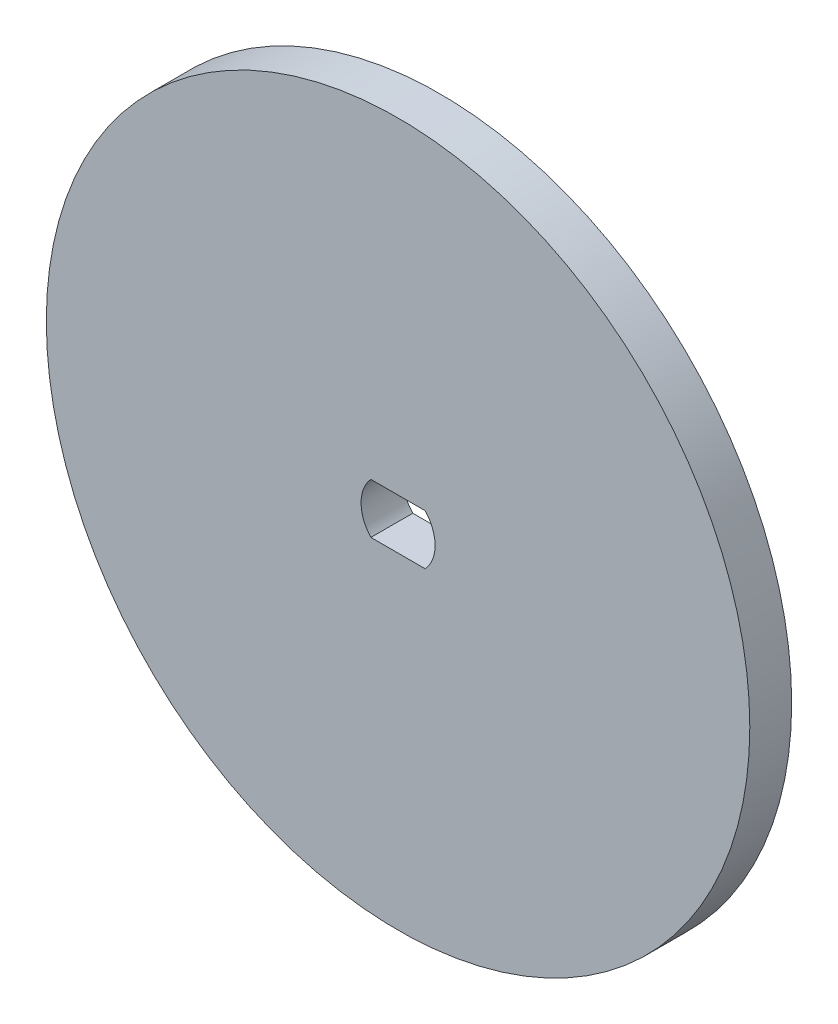
ISO-10303-21;
HEADER;
FILE_DESCRIPTION(('STEP AP214'),'2;1');
FILE_NAME('part.step','',(''),(''),'','','');
FILE_SCHEMA(('AUTOMOTIVE_DESIGN { 1 0 10303 214 1 1 1 1 }'));
ENDSEC;
DATA;
#1=APPLICATION_CONTEXT('core data for automotive mechanical design processes');
#2=APPLICATION_PROTOCOL_DEFINITION('international standard','automotive_design',2000,#1);
#3=PRODUCT_CONTEXT('',#1,'mechanical');
#4=PRODUCT('Part','Part','',(#3));
#5=PRODUCT_RELATED_PRODUCT_CATEGORY('part','',(#4));
#6=PRODUCT_DEFINITION_FORMATION('','',#4);
#7=PRODUCT_DEFINITION_CONTEXT('part definition',#1,'design');
#8=PRODUCT_DEFINITION('design','',#6,#7);
#9=PRODUCT_DEFINITION_SHAPE('','',#8);
#10=(LENGTH_UNIT() NAMED_UNIT(*) SI_UNIT(.MILLI.,.METRE.));
#11=(NAMED_UNIT(*) PLANE_ANGLE_UNIT() SI_UNIT($,.RADIAN.));
#12=(NAMED_UNIT(*) SI_UNIT($,.STERADIAN.) SOLID_ANGLE_UNIT());
#13=UNCERTAINTY_MEASURE_WITH_UNIT(LENGTH_MEASURE(1.E-05),#10,'distance_accuracy_value','');
#14=(GEOMETRIC_REPRESENTATION_CONTEXT(3) GLOBAL_UNCERTAINTY_ASSIGNED_CONTEXT((#13)) GLOBAL_UNIT_ASSIGNED_CONTEXT((#10,
#11,#12)) REPRESENTATION_CONTEXT('',''));
#15=CARTESIAN_POINT('',(0.,0.,0.));
#16=DIRECTION('',(0.,0.,1.));
#17=DIRECTION('',(1.,0.,0.));
#18=AXIS2_PLACEMENT_3D('',#15,#16,#17);
#19=CARTESIAN_POINT('',(0.,0.,3.175));
#20=DIRECTION('',(0.,0.,-1.));
#21=DIRECTION('',(-1.,0.,0.));
#22=AXIS2_PLACEMENT_3D('',#19,#20,#21);
#23=CYLINDRICAL_SURFACE('',#22,2.8067);
#24=CARTESIAN_POINT('',(0.,0.,0.));
#25=DIRECTION('',(0.,0.,1.));
#26=DIRECTION('',(1.,0.,0.));
#27=AXIS2_PLACEMENT_3D('',#24,#25,#26);
#28=CIRCLE('',#27,2.8067);
#29=CARTESIAN_POINT('',(-2.06119865369644,1.905,0.));
#30=VERTEX_POINT('',#29);
#31=CARTESIAN_POINT('',(-2.06119865369644,-1.905,0.));
#32=VERTEX_POINT('',#31);
#33=EDGE_CURVE('E104',#30,#32,#28,.T.);
#34=ORIENTED_EDGE('',*,*,#33,.F.);
#35=DIRECTION('',(0.,0.,-1.));
#36=VECTOR('',#35,1.);
#37=CARTESIAN_POINT('',(-2.06119865369644,1.905,3.175));
#38=LINE('',#37,#36);
#39=CARTESIAN_POINT('',(-2.06119865369644,1.905,3.175));
#40=VERTEX_POINT('',#39);
#41=EDGE_CURVE('E11',#40,#30,#38,.T.);
#42=ORIENTED_EDGE('',*,*,#41,.F.);
#43=CARTESIAN_POINT('',(0.,0.,3.175));
#44=DIRECTION('',(0.,0.,1.));
#45=DIRECTION('',(1.,0.,0.));
#46=AXIS2_PLACEMENT_3D('',#43,#44,#45);
#47=CIRCLE('',#46,2.8067);
#48=CARTESIAN_POINT('',(-2.06119865369644,-1.905,3.175));
#49=VERTEX_POINT('',#48);
#50=EDGE_CURVE('E86',#40,#49,#47,.T.);
#51=ORIENTED_EDGE('',*,*,#50,.T.);
#52=DIRECTION('',(0.,0.,-1.));
#53=VECTOR('',#52,1.);
#54=CARTESIAN_POINT('',(-2.06119865369644,-1.905,3.175));
#55=LINE('',#54,#53);
#56=EDGE_CURVE('E53',#49,#32,#55,.T.);
#57=ORIENTED_EDGE('',*,*,#56,.T.);
#58=EDGE_LOOP('',(#34,#42,#51,#57));
#59=FACE_BOUND('',#58,.T.);
#60=ADVANCED_FACE('F37',(#59),#23,.F.);
#61=CARTESIAN_POINT('',(0.,1.905,3.175));
#62=DIRECTION('',(0.,1.,0.));
#63=DIRECTION('',(0.,0.,1.));
#64=AXIS2_PLACEMENT_3D('',#61,#62,#63);
#65=PLANE('',#64);
#66=DIRECTION('',(1.,0.,0.));
#67=VECTOR('',#66,1.);
#68=CARTESIAN_POINT('',(0.,1.905,0.));
#69=LINE('',#68,#67);
#70=CARTESIAN_POINT('',(2.06119865369644,1.905,0.));
#71=VERTEX_POINT('',#70);
#72=EDGE_CURVE('E92',#30,#71,#69,.T.);
#73=ORIENTED_EDGE('',*,*,#72,.T.);
#74=DIRECTION('',(0.,0.,-1.));
#75=VECTOR('',#74,1.);
#76=CARTESIAN_POINT('',(2.06119865369644,1.905,3.175));
#77=LINE('',#76,#75);
#78=CARTESIAN_POINT('',(2.06119865369644,1.905,3.175));
#79=VERTEX_POINT('',#78);
#80=EDGE_CURVE('E45',#79,#71,#77,.T.);
#81=ORIENTED_EDGE('',*,*,#80,.F.);
#82=DIRECTION('',(1.,0.,0.));
#83=VECTOR('',#82,1.);
#84=CARTESIAN_POINT('',(0.,1.905,3.175));
#85=LINE('',#84,#83);
#86=EDGE_CURVE('E79',#40,#79,#85,.T.);
#87=ORIENTED_EDGE('',*,*,#86,.F.);
#88=ORIENTED_EDGE('',*,*,#41,.T.);
#89=EDGE_LOOP('',(#73,#81,#87,#88));
#90=FACE_BOUND('',#89,.T.);
#91=ADVANCED_FACE('F90',(#90),#65,.F.);
#92=CARTESIAN_POINT('',(0.,0.,3.175));
#93=DIRECTION('',(0.,0.,-1.));
#94=DIRECTION('',(-1.,0.,0.));
#95=AXIS2_PLACEMENT_3D('',#92,#93,#94);
#96=CYLINDRICAL_SURFACE('',#95,2.8067);
#97=CARTESIAN_POINT('',(0.,0.,0.));
#98=DIRECTION('',(0.,0.,1.));
#99=DIRECTION('',(1.,0.,0.));
#100=AXIS2_PLACEMENT_3D('',#97,#98,#99);
#101=CIRCLE('',#100,2.8067);
#102=CARTESIAN_POINT('',(2.06119865369644,-1.905,0.));
#103=VERTEX_POINT('',#102);
#104=EDGE_CURVE('E107',#103,#71,#101,.T.);
#105=ORIENTED_EDGE('',*,*,#104,.F.);
#106=DIRECTION('',(0.,0.,-1.));
#107=VECTOR('',#106,1.);
#108=CARTESIAN_POINT('',(2.06119865369644,-1.905,3.175));
#109=LINE('',#108,#107);
#110=CARTESIAN_POINT('',(2.06119865369644,-1.905,3.175));
#111=VERTEX_POINT('',#110);
#112=EDGE_CURVE('E66',#111,#103,#109,.T.);
#113=ORIENTED_EDGE('',*,*,#112,.F.);
#114=CARTESIAN_POINT('',(0.,0.,3.175));
#115=DIRECTION('',(0.,0.,1.));
#116=DIRECTION('',(1.,0.,0.));
#117=AXIS2_PLACEMENT_3D('',#114,#115,#116);
#118=CIRCLE('',#117,2.8067);
#119=EDGE_CURVE('E85',#111,#79,#118,.T.);
#120=ORIENTED_EDGE('',*,*,#119,.T.);
#121=ORIENTED_EDGE('',*,*,#80,.T.);
#122=EDGE_LOOP('',(#105,#113,#120,#121));
#123=FACE_BOUND('',#122,.T.);
#124=ADVANCED_FACE('F95',(#123),#96,.F.);
#125=CARTESIAN_POINT('',(0.,-1.905,3.175));
#126=DIRECTION('',(0.,1.,0.));
#127=DIRECTION('',(0.,0.,1.));
#128=AXIS2_PLACEMENT_3D('',#125,#126,#127);
#129=PLANE('',#128);
#130=DIRECTION('',(1.,0.,0.));
#131=VECTOR('',#130,1.);
#132=CARTESIAN_POINT('',(0.,-1.905,0.));
#133=LINE('',#132,#131);
#134=EDGE_CURVE('E109',#32,#103,#133,.T.);
#135=ORIENTED_EDGE('',*,*,#134,.F.);
#136=ORIENTED_EDGE('',*,*,#56,.F.);
#137=DIRECTION('',(1.,0.,0.));
#138=VECTOR('',#137,1.);
#139=CARTESIAN_POINT('',(0.,-1.905,3.175));
#140=LINE('',#139,#138);
#141=EDGE_CURVE('E96',#49,#111,#140,.T.);
#142=ORIENTED_EDGE('',*,*,#141,.T.);
#143=ORIENTED_EDGE('',*,*,#112,.T.);
#144=EDGE_LOOP('',(#135,#136,#142,#143));
#145=FACE_BOUND('',#144,.T.);
#146=ADVANCED_FACE('F118',(#145),#129,.T.);
#147=CARTESIAN_POINT('',(0.,0.,3.175));
#148=DIRECTION('',(0.,0.,-1.));
#149=DIRECTION('',(-1.,0.,0.));
#150=AXIS2_PLACEMENT_3D('',#147,#148,#149);
#151=CYLINDRICAL_SURFACE('',#150,26.67);
#152=CARTESIAN_POINT('',(0.,0.,3.175));
#153=DIRECTION('',(0.,0.,1.));
#154=DIRECTION('',(1.,0.,0.));
#155=AXIS2_PLACEMENT_3D('',#152,#153,#154);
#156=CIRCLE('',#155,26.67);
#157=CARTESIAN_POINT('',(26.67,0.,3.175));
#158=VERTEX_POINT('',#157);
#159=EDGE_CURVE('E98',#158,#158,#156,.T.);
#160=ORIENTED_EDGE('',*,*,#159,.F.);
#161=EDGE_LOOP('',(#160));
#162=FACE_BOUND('',#161,.T.);
#163=CARTESIAN_POINT('',(0.,0.,0.));
#164=DIRECTION('',(0.,0.,1.));
#165=DIRECTION('',(1.,0.,0.));
#166=AXIS2_PLACEMENT_3D('',#163,#164,#165);
#167=CIRCLE('',#166,26.67);
#168=CARTESIAN_POINT('',(26.67,0.,0.));
#169=VERTEX_POINT('',#168);
#170=EDGE_CURVE('E112',#169,#169,#167,.T.);
#171=ORIENTED_EDGE('',*,*,#170,.T.);
#172=EDGE_LOOP('',(#171));
#173=FACE_BOUND('',#172,.T.);
#174=ADVANCED_FACE('F120',(#162,#173),#151,.T.);
#175=CARTESIAN_POINT('',(0.,0.,3.175));
#176=DIRECTION('',(0.,0.,1.));
#177=DIRECTION('',(1.,0.,0.));
#178=AXIS2_PLACEMENT_3D('',#175,#176,#177);
#179=PLANE('',#178);
#180=ORIENTED_EDGE('',*,*,#50,.F.);
#181=ORIENTED_EDGE('',*,*,#86,.T.);
#182=ORIENTED_EDGE('',*,*,#119,.F.);
#183=ORIENTED_EDGE('',*,*,#141,.F.);
#184=EDGE_LOOP('',(#180,#181,#182,#183));
#185=FACE_BOUND('',#184,.T.);
#186=ORIENTED_EDGE('',*,*,#159,.T.);
#187=EDGE_LOOP('',(#186));
#188=FACE_BOUND('',#187,.T.);
#189=ADVANCED_FACE('F81',(#185,#188),#179,.T.);
#190=CARTESIAN_POINT('',(0.,0.,0.));
#191=DIRECTION('',(0.,0.,1.));
#192=DIRECTION('',(1.,0.,0.));
#193=AXIS2_PLACEMENT_3D('',#190,#191,#192);
#194=PLANE('',#193);
#195=ORIENTED_EDGE('',*,*,#33,.T.);
#196=ORIENTED_EDGE('',*,*,#134,.T.);
#197=ORIENTED_EDGE('',*,*,#104,.T.);
#198=ORIENTED_EDGE('',*,*,#72,.F.);
#199=EDGE_LOOP('',(#195,#196,#197,#198));
#200=FACE_BOUND('',#199,.T.);
#201=ORIENTED_EDGE('',*,*,#170,.F.);
#202=EDGE_LOOP('',(#201));
#203=FACE_BOUND('',#202,.T.);
#204=ADVANCED_FACE('F158',(#200,#203),#194,.F.);
#205=CLOSED_SHELL('',(#60,#91,#124,#146,#174,#189,#204));
#206=MANIFOLD_SOLID_BREP('B2',#205);
#207=ADVANCED_BREP_SHAPE_REPRESENTATION('',(#18,#206),#14);
#208=SHAPE_DEFINITION_REPRESENTATION(#9,#207);
ENDSEC;
END-ISO-10303-21;
